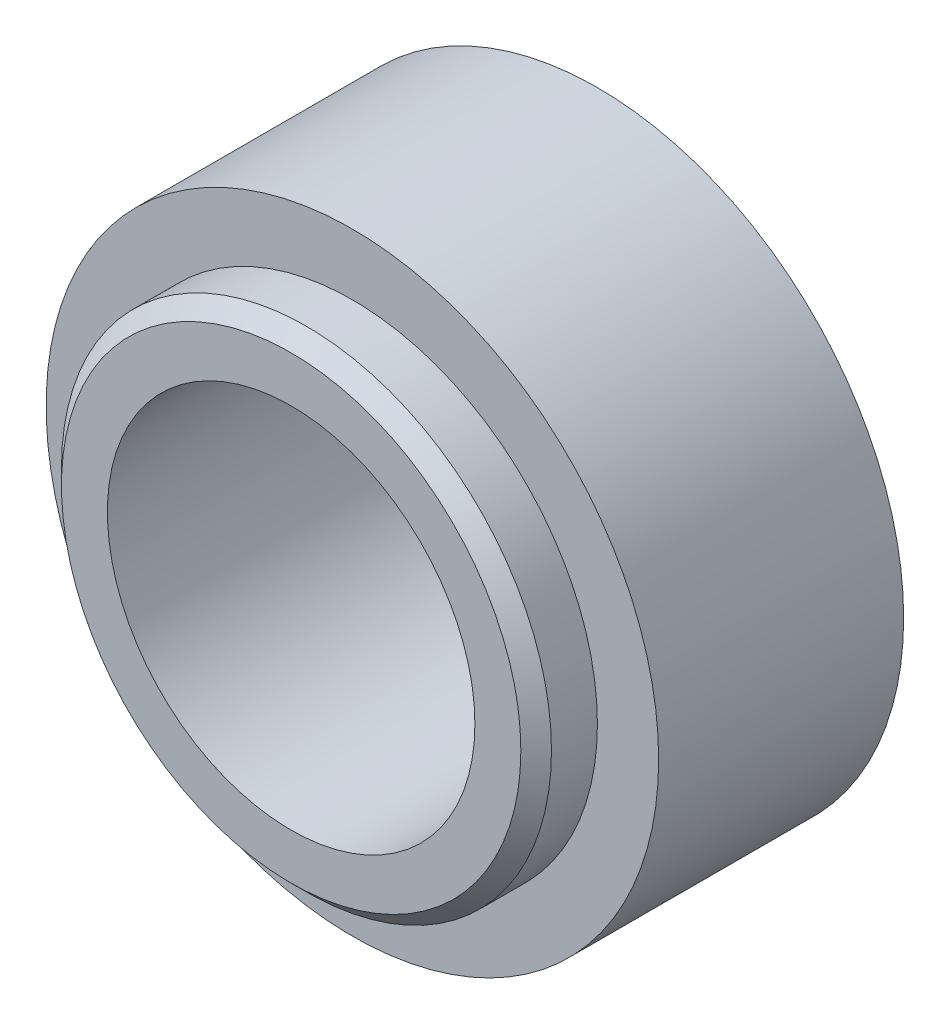
ISO-10303-21;
HEADER;
FILE_DESCRIPTION(('STEP AP214'),'2;1');
FILE_NAME('part.step','',(''),(''),'','','');
FILE_SCHEMA(('AUTOMOTIVE_DESIGN { 1 0 10303 214 1 1 1 1 }'));
ENDSEC;
DATA;
#1=APPLICATION_CONTEXT('core data for automotive mechanical design processes');
#2=APPLICATION_PROTOCOL_DEFINITION('international standard','automotive_design',2000,#1);
#3=PRODUCT_CONTEXT('',#1,'mechanical');
#4=PRODUCT('Part','Part','',(#3));
#5=PRODUCT_RELATED_PRODUCT_CATEGORY('part','',(#4));
#6=PRODUCT_DEFINITION_FORMATION('','',#4);
#7=PRODUCT_DEFINITION_CONTEXT('part definition',#1,'design');
#8=PRODUCT_DEFINITION('design','',#6,#7);
#9=PRODUCT_DEFINITION_SHAPE('','',#8);
#10=(LENGTH_UNIT() NAMED_UNIT(*) SI_UNIT(.MILLI.,.METRE.));
#11=(NAMED_UNIT(*) PLANE_ANGLE_UNIT() SI_UNIT($,.RADIAN.));
#12=(NAMED_UNIT(*) SI_UNIT($,.STERADIAN.) SOLID_ANGLE_UNIT());
#13=UNCERTAINTY_MEASURE_WITH_UNIT(LENGTH_MEASURE(1.E-05),#10,'distance_accuracy_value','');
#14=(GEOMETRIC_REPRESENTATION_CONTEXT(3) GLOBAL_UNCERTAINTY_ASSIGNED_CONTEXT((#13)) GLOBAL_UNIT_ASSIGNED_CONTEXT((#10,
#11,#12)) REPRESENTATION_CONTEXT('',''));
#15=CARTESIAN_POINT('',(0.,0.,0.));
#16=DIRECTION('',(0.,0.,1.));
#17=DIRECTION('',(1.,0.,0.));
#18=AXIS2_PLACEMENT_3D('',#15,#16,#17);
#19=CARTESIAN_POINT('',(0.,0.,25.4));
#20=DIRECTION('',(0.,0.,-0.999999999999999));
#21=DIRECTION('',(-0.999999999999999,0.,0.));
#22=AXIS2_PLACEMENT_3D('',#19,#20,#21);
#23=CYLINDRICAL_SURFACE('',#22,31.75);
#24=CARTESIAN_POINT('',(0.,0.,25.4));
#25=DIRECTION('',(0.,0.,0.999999999999999));
#26=DIRECTION('',(0.999999999999999,0.,0.));
#27=AXIS2_PLACEMENT_3D('',#24,#25,#26);
#28=CIRCLE('',#27,31.75);
#29=CARTESIAN_POINT('',(31.75,0.,25.4));
#30=VERTEX_POINT('',#29);
#31=EDGE_CURVE('E64',#30,#30,#28,.T.);
#32=ORIENTED_EDGE('',*,*,#31,.F.);
#33=EDGE_LOOP('',(#32));
#34=FACE_BOUND('',#33,.T.);
#35=CARTESIAN_POINT('',(0.,0.,0.));
#36=DIRECTION('',(0.,0.,0.999999999999999));
#37=DIRECTION('',(0.999999999999999,0.,0.));
#38=AXIS2_PLACEMENT_3D('',#35,#36,#37);
#39=CIRCLE('',#38,31.75);
#40=CARTESIAN_POINT('',(31.75,0.,0.));
#41=VERTEX_POINT('',#40);
#42=EDGE_CURVE('E65',#41,#41,#39,.T.);
#43=ORIENTED_EDGE('',*,*,#42,.T.);
#44=EDGE_LOOP('',(#43));
#45=FACE_BOUND('',#44,.T.);
#46=ADVANCED_FACE('F44',(#34,#45),#23,.T.);
#47=CARTESIAN_POINT('',(0.,0.,25.4));
#48=DIRECTION('',(0.,0.,0.999999999999999));
#49=DIRECTION('',(0.999999999999999,0.,0.));
#50=AXIS2_PLACEMENT_3D('',#47,#48,#49);
#51=PLANE('',#50);
#52=CARTESIAN_POINT('',(0.,0.,25.4));
#53=DIRECTION('',(0.,0.,0.999999999999999));
#54=DIRECTION('',(0.999999999999999,0.,0.));
#55=AXIS2_PLACEMENT_3D('',#52,#53,#54);
#56=CIRCLE('',#55,25.4);
#57=CARTESIAN_POINT('',(25.4,0.,25.4));
#58=VERTEX_POINT('',#57);
#59=EDGE_CURVE('E68',#58,#58,#56,.T.);
#60=ORIENTED_EDGE('',*,*,#59,.F.);
#61=EDGE_LOOP('',(#60));
#62=FACE_BOUND('',#61,.T.);
#63=ORIENTED_EDGE('',*,*,#31,.T.);
#64=EDGE_LOOP('',(#63));
#65=FACE_BOUND('',#64,.T.);
#66=ADVANCED_FACE('F91',(#62,#65),#51,.T.);
#67=CARTESIAN_POINT('',(0.,0.,0.));
#68=DIRECTION('',(0.,0.,0.999999999999999));
#69=DIRECTION('',(0.999999999999999,0.,0.));
#70=AXIS2_PLACEMENT_3D('',#67,#68,#69);
#71=PLANE('',#70);
#72=CARTESIAN_POINT('',(0.,0.,0.));
#73=DIRECTION('',(0.,0.,0.999999999999999));
#74=DIRECTION('',(0.999999999999999,0.,0.));
#75=AXIS2_PLACEMENT_3D('',#72,#73,#74);
#76=CIRCLE('',#75,20.6375);
#77=CARTESIAN_POINT('',(20.6375,0.,0.));
#78=VERTEX_POINT('',#77);
#79=EDGE_CURVE('E59',#78,#78,#76,.T.);
#80=ORIENTED_EDGE('',*,*,#79,.T.);
#81=EDGE_LOOP('',(#80));
#82=FACE_BOUND('',#81,.T.);
#83=ORIENTED_EDGE('',*,*,#42,.F.);
#84=EDGE_LOOP('',(#83));
#85=FACE_BOUND('',#84,.T.);
#86=ADVANCED_FACE('F97',(#82,#85),#71,.F.);
#87=CARTESIAN_POINT('',(0.,0.,31.75));
#88=DIRECTION('',(0.,0.,-0.999999999999999));
#89=DIRECTION('',(-0.999999999999999,0.,0.));
#90=AXIS2_PLACEMENT_3D('',#87,#88,#89);
#91=CYLINDRICAL_SURFACE('',#90,19.05);
#92=CARTESIAN_POINT('',(0.,0.,1.58750000000002));
#93=DIRECTION('',(0.,0.,0.999999999999999));
#94=DIRECTION('',(0.999999999999999,0.,0.));
#95=AXIS2_PLACEMENT_3D('',#92,#93,#94);
#96=CIRCLE('',#95,19.05);
#97=CARTESIAN_POINT('',(19.05,0.,1.58750000000002));
#98=VERTEX_POINT('',#97);
#99=EDGE_CURVE('E55',#98,#98,#96,.F.);
#100=ORIENTED_EDGE('',*,*,#99,.T.);
#101=EDGE_LOOP('',(#100));
#102=FACE_BOUND('',#101,.T.);
#103=CARTESIAN_POINT('',(0.,0.,31.75));
#104=DIRECTION('',(0.,0.,0.999999999999999));
#105=DIRECTION('',(0.999999999999999,0.,0.));
#106=AXIS2_PLACEMENT_3D('',#103,#104,#105);
#107=CIRCLE('',#106,19.05);
#108=CARTESIAN_POINT('',(19.05,0.,31.75));
#109=VERTEX_POINT('',#108);
#110=EDGE_CURVE('E69',#109,#109,#107,.T.);
#111=ORIENTED_EDGE('',*,*,#110,.T.);
#112=EDGE_LOOP('',(#111));
#113=FACE_BOUND('',#112,.T.);
#114=ADVANCED_FACE('F77',(#102,#113),#91,.F.);
#115=CARTESIAN_POINT('',(0.,0.,31.75));
#116=DIRECTION('',(0.,0.,-0.999999999999999));
#117=DIRECTION('',(-0.999999999999999,0.,0.));
#118=AXIS2_PLACEMENT_3D('',#115,#116,#117);
#119=CYLINDRICAL_SURFACE('',#118,25.4);
#120=CARTESIAN_POINT('',(0.,0.,30.1625));
#121=DIRECTION('',(0.,0.,0.999999999999999));
#122=DIRECTION('',(0.999999999999999,0.,0.));
#123=AXIS2_PLACEMENT_3D('',#120,#121,#122);
#124=CIRCLE('',#123,25.4);
#125=CARTESIAN_POINT('',(25.4,0.,30.1625));
#126=VERTEX_POINT('',#125);
#127=EDGE_CURVE('E12',#126,#126,#124,.F.);
#128=ORIENTED_EDGE('',*,*,#127,.T.);
#129=EDGE_LOOP('',(#128));
#130=FACE_BOUND('',#129,.T.);
#131=ORIENTED_EDGE('',*,*,#59,.T.);
#132=EDGE_LOOP('',(#131));
#133=FACE_BOUND('',#132,.T.);
#134=ADVANCED_FACE('F82',(#130,#133),#119,.T.);
#135=CARTESIAN_POINT('',(0.,0.,31.75));
#136=DIRECTION('',(0.,0.,0.999999999999999));
#137=DIRECTION('',(0.999999999999999,0.,0.));
#138=AXIS2_PLACEMENT_3D('',#135,#136,#137);
#139=PLANE('',#138);
#140=CARTESIAN_POINT('',(0.,0.,31.75));
#141=DIRECTION('',(0.,0.,0.999999999999999));
#142=DIRECTION('',(0.999999999999999,0.,0.));
#143=AXIS2_PLACEMENT_3D('',#140,#141,#142);
#144=CIRCLE('',#143,23.8125);
#145=CARTESIAN_POINT('',(23.8125,0.,31.75));
#146=VERTEX_POINT('',#145);
#147=EDGE_CURVE('E51',#146,#146,#144,.T.);
#148=ORIENTED_EDGE('',*,*,#147,.T.);
#149=EDGE_LOOP('',(#148));
#150=FACE_BOUND('',#149,.T.);
#151=ORIENTED_EDGE('',*,*,#110,.F.);
#152=EDGE_LOOP('',(#151));
#153=FACE_BOUND('',#152,.T.);
#154=ADVANCED_FACE('F79',(#150,#153),#139,.T.);
#155=CARTESIAN_POINT('',(0.,0.,0.));
#156=DIRECTION('',(0.,0.,-0.999999999999999));
#157=DIRECTION('',(-0.999999999999999,0.,0.));
#158=AXIS2_PLACEMENT_3D('',#155,#156,#157);
#159=CONICAL_SURFACE('',#158,20.6375,0.785398163397448);
#160=ORIENTED_EDGE('',*,*,#99,.F.);
#161=EDGE_LOOP('',(#160));
#162=FACE_BOUND('',#161,.T.);
#163=ORIENTED_EDGE('',*,*,#79,.F.);
#164=EDGE_LOOP('',(#163));
#165=FACE_BOUND('',#164,.T.);
#166=ADVANCED_FACE('F81',(#162,#165),#159,.F.);
#167=CARTESIAN_POINT('',(0.,0.,31.75));
#168=DIRECTION('',(0.,0.,-0.999999999999999));
#169=DIRECTION('',(-0.999999999999999,0.,0.));
#170=AXIS2_PLACEMENT_3D('',#167,#168,#169);
#171=CONICAL_SURFACE('',#170,23.8125,0.785398163397445);
#172=ORIENTED_EDGE('',*,*,#127,.F.);
#173=EDGE_LOOP('',(#172));
#174=FACE_BOUND('',#173,.T.);
#175=ORIENTED_EDGE('',*,*,#147,.F.);
#176=EDGE_LOOP('',(#175));
#177=FACE_BOUND('',#176,.T.);
#178=ADVANCED_FACE('F46',(#174,#177),#171,.T.);
#179=CLOSED_SHELL('',(#46,#66,#86,#114,#134,#154,#166,#178));
#180=MANIFOLD_SOLID_BREP('B2',#179);
#181=ADVANCED_BREP_SHAPE_REPRESENTATION('',(#18,#180),#14);
#182=SHAPE_DEFINITION_REPRESENTATION(#9,#181);
ENDSEC;
END-ISO-10303-21;
